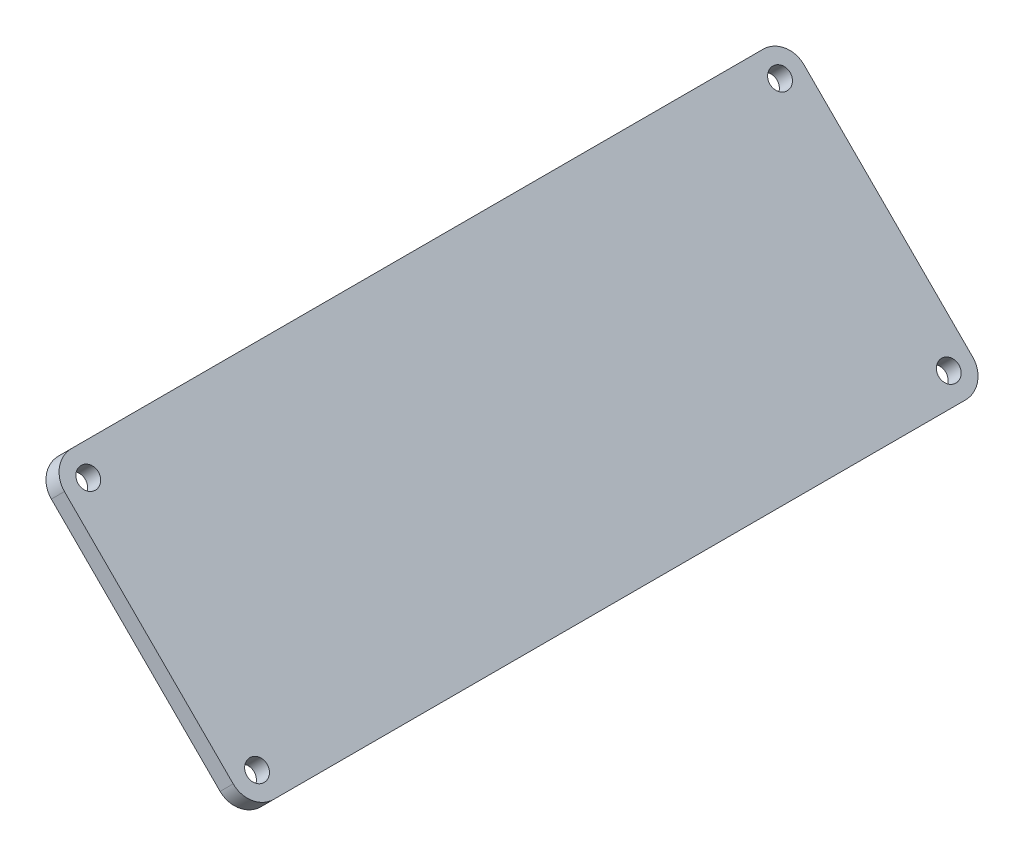
ISO-10303-21;
HEADER;
FILE_DESCRIPTION(('STEP AP214'),'2;1');
FILE_NAME('part.step','',(''),(''),'','','');
FILE_SCHEMA(('AUTOMOTIVE_DESIGN { 1 0 10303 214 1 1 1 1 }'));
ENDSEC;
DATA;
#1=APPLICATION_CONTEXT('core data for automotive mechanical design processes');
#2=APPLICATION_PROTOCOL_DEFINITION('international standard','automotive_design',2000,#1);
#3=PRODUCT_CONTEXT('',#1,'mechanical');
#4=PRODUCT('Part','Part','',(#3));
#5=PRODUCT_RELATED_PRODUCT_CATEGORY('part','',(#4));
#6=PRODUCT_DEFINITION_FORMATION('','',#4);
#7=PRODUCT_DEFINITION_CONTEXT('part definition',#1,'design');
#8=PRODUCT_DEFINITION('design','',#6,#7);
#9=PRODUCT_DEFINITION_SHAPE('','',#8);
#10=(LENGTH_UNIT() NAMED_UNIT(*) SI_UNIT(.MILLI.,.METRE.));
#11=(NAMED_UNIT(*) PLANE_ANGLE_UNIT() SI_UNIT($,.RADIAN.));
#12=(NAMED_UNIT(*) SI_UNIT($,.STERADIAN.) SOLID_ANGLE_UNIT());
#13=UNCERTAINTY_MEASURE_WITH_UNIT(LENGTH_MEASURE(1.E-05),#10,'distance_accuracy_value','');
#14=(GEOMETRIC_REPRESENTATION_CONTEXT(3) GLOBAL_UNCERTAINTY_ASSIGNED_CONTEXT((#13)) GLOBAL_UNIT_ASSIGNED_CONTEXT((#10,
#11,#12)) REPRESENTATION_CONTEXT('',''));
#15=CARTESIAN_POINT('',(0.,0.,0.));
#16=DIRECTION('',(0.,0.,1.));
#17=DIRECTION('',(1.,0.,0.));
#18=AXIS2_PLACEMENT_3D('',#15,#16,#17);
#19=CARTESIAN_POINT('',(367.826239746811,480.354328766444,453.26943762346));
#20=DIRECTION('',(0.707106781186549,0.707106781186546,0.));
#21=DIRECTION('',(-0.707106781186546,0.707106781186549,0.));
#22=AXIS2_PLACEMENT_3D('',#19,#20,#21);
#23=PLANE('',#22);
#24=CARTESIAN_POINT('',(396.124653129897,452.055915383359,453.26943762346));
#25=DIRECTION('',(0.707106781186549,0.707106781186546,0.));
#26=DIRECTION('',(-0.707106781186546,0.707106781186549,0.));
#27=AXIS2_PLACEMENT_3D('',#24,#25,#26);
#28=CIRCLE('',#27,1.70000000000007);
#29=CARTESIAN_POINT('',(394.92257160188,453.257996911376,453.26943762346));
#30=VERTEX_POINT('',#29);
#31=EDGE_CURVE('E188',#30,#30,#28,.T.);
#32=ORIENTED_EDGE('',*,*,#31,.F.);
#33=EDGE_LOOP('',(#32));
#34=FACE_BOUND('',#33,.T.);
#35=CARTESIAN_POINT('',(367.826239746811,480.354328766444,569.26943762346));
#36=DIRECTION('',(0.707106781186549,0.707106781186546,0.));
#37=DIRECTION('',(-0.707106781186546,0.707106781186549,0.));
#38=AXIS2_PLACEMENT_3D('',#35,#36,#37);
#39=CIRCLE('',#38,1.70000000000007);
#40=CARTESIAN_POINT('',(366.624158218794,481.556410294462,569.26943762346));
#41=VERTEX_POINT('',#40);
#42=EDGE_CURVE('E134',#41,#41,#39,.T.);
#43=ORIENTED_EDGE('',*,*,#42,.F.);
#44=EDGE_LOOP('',(#43));
#45=FACE_BOUND('',#44,.T.);
#46=CARTESIAN_POINT('',(367.826239746811,480.354328766444,453.26943762346));
#47=DIRECTION('',(0.707106781186549,0.707106781186546,0.));
#48=DIRECTION('',(-0.707106781186546,0.707106781186549,0.));
#49=AXIS2_PLACEMENT_3D('',#46,#47,#48);
#50=CIRCLE('',#49,4.00000000000001);
#51=CARTESIAN_POINT('',(367.826239746811,480.354328766444,449.26943762346));
#52=VERTEX_POINT('',#51);
#53=CARTESIAN_POINT('',(364.997812622065,483.182755891191,453.26943762346));
#54=VERTEX_POINT('',#53);
#55=EDGE_CURVE('E145',#52,#54,#50,.T.);
#56=ORIENTED_EDGE('',*,*,#55,.T.);
#57=DIRECTION('',(0.,0.,1.));
#58=VECTOR('',#57,1.);
#59=CARTESIAN_POINT('',(364.997812622065,483.182755891191,453.26943762346));
#60=LINE('',#59,#58);
#61=CARTESIAN_POINT('',(364.997812622065,483.182755891191,569.26943762346));
#62=VERTEX_POINT('',#61);
#63=EDGE_CURVE('E93',#54,#62,#60,.T.);
#64=ORIENTED_EDGE('',*,*,#63,.T.);
#65=CARTESIAN_POINT('',(367.826239746811,480.354328766444,569.26943762346));
#66=DIRECTION('',(0.707106781186549,0.707106781186546,0.));
#67=DIRECTION('',(-0.707106781186546,0.707106781186549,0.));
#68=AXIS2_PLACEMENT_3D('',#65,#66,#67);
#69=CIRCLE('',#68,4.00000000000003);
#70=CARTESIAN_POINT('',(367.826239746811,480.354328766444,573.26943762346));
#71=VERTEX_POINT('',#70);
#72=EDGE_CURVE('E160',#62,#71,#69,.T.);
#73=ORIENTED_EDGE('',*,*,#72,.T.);
#74=DIRECTION('',(0.707106781186546,-0.707106781186549,0.));
#75=VECTOR('',#74,1.);
#76=CARTESIAN_POINT('',(367.826239746811,480.354328766444,573.26943762346));
#77=LINE('',#76,#75);
#78=CARTESIAN_POINT('',(396.124653129897,452.055915383359,573.26943762346));
#79=VERTEX_POINT('',#78);
#80=EDGE_CURVE('E173',#71,#79,#77,.T.);
#81=ORIENTED_EDGE('',*,*,#80,.T.);
#82=CARTESIAN_POINT('',(396.124653129897,452.055915383359,569.26943762346));
#83=DIRECTION('',(0.707106781186549,0.707106781186546,0.));
#84=DIRECTION('',(-0.707106781186546,0.707106781186549,0.));
#85=AXIS2_PLACEMENT_3D('',#82,#83,#84);
#86=CIRCLE('',#85,3.99999999999999);
#87=CARTESIAN_POINT('',(398.953080254643,449.227488258613,569.26943762346));
#88=VERTEX_POINT('',#87);
#89=EDGE_CURVE('E112',#79,#88,#86,.T.);
#90=ORIENTED_EDGE('',*,*,#89,.T.);
#91=DIRECTION('',(0.,0.,-1.));
#92=VECTOR('',#91,1.);
#93=CARTESIAN_POINT('',(398.953080254643,449.227488258613,569.26943762346));
#94=LINE('',#93,#92);
#95=CARTESIAN_POINT('',(398.953080254643,449.227488258613,453.26943762346));
#96=VERTEX_POINT('',#95);
#97=EDGE_CURVE('E106',#88,#96,#94,.T.);
#98=ORIENTED_EDGE('',*,*,#97,.T.);
#99=CARTESIAN_POINT('',(396.124653129897,452.055915383359,453.26943762346));
#100=DIRECTION('',(0.707106781186549,0.707106781186546,0.));
#101=DIRECTION('',(-0.707106781186546,0.707106781186549,0.));
#102=AXIS2_PLACEMENT_3D('',#99,#100,#101);
#103=CIRCLE('',#102,3.99999999999999);
#104=CARTESIAN_POINT('',(396.124653129897,452.055915383359,449.26943762346));
#105=VERTEX_POINT('',#104);
#106=EDGE_CURVE('E110',#96,#105,#103,.T.);
#107=ORIENTED_EDGE('',*,*,#106,.T.);
#108=DIRECTION('',(-0.707106781186546,0.707106781186549,0.));
#109=VECTOR('',#108,1.);
#110=CARTESIAN_POINT('',(396.124653129897,452.055915383359,449.26943762346));
#111=LINE('',#110,#109);
#112=EDGE_CURVE('E50',#105,#52,#111,.T.);
#113=ORIENTED_EDGE('',*,*,#112,.T.);
#114=EDGE_LOOP('',(#56,#64,#73,#81,#90,#98,#107,#113));
#115=FACE_BOUND('',#114,.T.);
#116=CARTESIAN_POINT('',(396.124653129897,452.055915383359,569.26943762346));
#117=DIRECTION('',(0.707106781186549,0.707106781186546,0.));
#118=DIRECTION('',(-0.707106781186546,0.707106781186549,0.));
#119=AXIS2_PLACEMENT_3D('',#116,#117,#118);
#120=CIRCLE('',#119,1.7000000000003);
#121=CARTESIAN_POINT('',(394.92257160188,453.257996911376,569.26943762346));
#122=VERTEX_POINT('',#121);
#123=EDGE_CURVE('E182',#122,#122,#120,.T.);
#124=ORIENTED_EDGE('',*,*,#123,.F.);
#125=EDGE_LOOP('',(#124));
#126=FACE_BOUND('',#125,.T.);
#127=CARTESIAN_POINT('',(367.826239746811,480.354328766444,453.26943762346));
#128=DIRECTION('',(0.707106781186549,0.707106781186546,0.));
#129=DIRECTION('',(-0.707106781186546,0.707106781186549,0.));
#130=AXIS2_PLACEMENT_3D('',#127,#128,#129);
#131=CIRCLE('',#130,1.70000000000009);
#132=CARTESIAN_POINT('',(366.624158218794,481.556410294462,453.26943762346));
#133=VERTEX_POINT('',#132);
#134=EDGE_CURVE('E194',#133,#133,#131,.T.);
#135=ORIENTED_EDGE('',*,*,#134,.F.);
#136=EDGE_LOOP('',(#135));
#137=FACE_BOUND('',#136,.T.);
#138=ADVANCED_FACE('F33',(#34,#45,#115,#126,#137),#23,.T.);
#139=CARTESIAN_POINT('',(365.634208725133,478.162297744766,453.26943762346));
#140=DIRECTION('',(0.707106781186549,0.707106781186546,0.));
#141=DIRECTION('',(-0.707106781186546,0.707106781186549,0.));
#142=AXIS2_PLACEMENT_3D('',#139,#140,#141);
#143=PLANE('',#142);
#144=CARTESIAN_POINT('',(365.634208725133,478.162297744766,453.26943762346));
#145=DIRECTION('',(0.707106781186549,0.707106781186546,0.));
#146=DIRECTION('',(-0.707106781186546,0.707106781186549,0.));
#147=AXIS2_PLACEMENT_3D('',#144,#145,#146);
#148=CIRCLE('',#147,4.00000000000001);
#149=CARTESIAN_POINT('',(365.634208725133,478.162297744766,449.26943762346));
#150=VERTEX_POINT('',#149);
#151=CARTESIAN_POINT('',(362.805781600387,480.990724869512,453.26943762346));
#152=VERTEX_POINT('',#151);
#153=EDGE_CURVE('E130',#150,#152,#148,.T.);
#154=ORIENTED_EDGE('',*,*,#153,.F.);
#155=DIRECTION('',(-0.707106781186546,0.707106781186549,0.));
#156=VECTOR('',#155,1.);
#157=CARTESIAN_POINT('',(393.932622108219,449.86388436168,449.26943762346));
#158=LINE('',#157,#156);
#159=CARTESIAN_POINT('',(393.932622108219,449.86388436168,449.26943762346));
#160=VERTEX_POINT('',#159);
#161=EDGE_CURVE('E85',#160,#150,#158,.T.);
#162=ORIENTED_EDGE('',*,*,#161,.F.);
#163=CARTESIAN_POINT('',(393.932622108219,449.86388436168,453.26943762346));
#164=DIRECTION('',(0.707106781186549,0.707106781186546,0.));
#165=DIRECTION('',(-0.707106781186546,0.707106781186549,0.));
#166=AXIS2_PLACEMENT_3D('',#163,#164,#165);
#167=CIRCLE('',#166,3.99999999999999);
#168=CARTESIAN_POINT('',(396.761049232965,447.035457236934,453.26943762346));
#169=VERTEX_POINT('',#168);
#170=EDGE_CURVE('E79',#169,#160,#167,.T.);
#171=ORIENTED_EDGE('',*,*,#170,.F.);
#172=DIRECTION('',(0.,0.,-1.));
#173=VECTOR('',#172,1.);
#174=CARTESIAN_POINT('',(396.761049232965,447.035457236934,569.26943762346));
#175=LINE('',#174,#173);
#176=CARTESIAN_POINT('',(396.761049232965,447.035457236934,569.26943762346));
#177=VERTEX_POINT('',#176);
#178=EDGE_CURVE('E120',#177,#169,#175,.T.);
#179=ORIENTED_EDGE('',*,*,#178,.F.);
#180=CARTESIAN_POINT('',(393.932622108219,449.86388436168,569.26943762346));
#181=DIRECTION('',(0.707106781186549,0.707106781186546,0.));
#182=DIRECTION('',(-0.707106781186546,0.707106781186549,0.));
#183=AXIS2_PLACEMENT_3D('',#180,#181,#182);
#184=CIRCLE('',#183,3.99999999999999);
#185=CARTESIAN_POINT('',(393.932622108219,449.86388436168,573.26943762346));
#186=VERTEX_POINT('',#185);
#187=EDGE_CURVE('E140',#186,#177,#184,.T.);
#188=ORIENTED_EDGE('',*,*,#187,.F.);
#189=DIRECTION('',(0.707106781186546,-0.707106781186549,0.));
#190=VECTOR('',#189,1.);
#191=CARTESIAN_POINT('',(365.634208725133,478.162297744766,573.26943762346));
#192=LINE('',#191,#190);
#193=CARTESIAN_POINT('',(365.634208725133,478.162297744766,573.26943762346));
#194=VERTEX_POINT('',#193);
#195=EDGE_CURVE('E138',#194,#186,#192,.T.);
#196=ORIENTED_EDGE('',*,*,#195,.F.);
#197=CARTESIAN_POINT('',(365.634208725133,478.162297744766,569.26943762346));
#198=DIRECTION('',(0.707106781186549,0.707106781186546,0.));
#199=DIRECTION('',(-0.707106781186546,0.707106781186549,0.));
#200=AXIS2_PLACEMENT_3D('',#197,#198,#199);
#201=CIRCLE('',#200,4.00000000000003);
#202=CARTESIAN_POINT('',(362.805781600387,480.990724869512,569.26943762346));
#203=VERTEX_POINT('',#202);
#204=EDGE_CURVE('E136',#203,#194,#201,.T.);
#205=ORIENTED_EDGE('',*,*,#204,.F.);
#206=DIRECTION('',(0.,0.,1.));
#207=VECTOR('',#206,1.);
#208=CARTESIAN_POINT('',(362.805781600387,480.990724869512,453.26943762346));
#209=LINE('',#208,#207);
#210=EDGE_CURVE('E133',#152,#203,#209,.T.);
#211=ORIENTED_EDGE('',*,*,#210,.F.);
#212=EDGE_LOOP('',(#154,#162,#171,#179,#188,#196,#205,#211));
#213=FACE_BOUND('',#212,.T.);
#214=CARTESIAN_POINT('',(365.634208725133,478.162297744766,569.26943762346));
#215=DIRECTION('',(0.707106781186549,0.707106781186546,0.));
#216=DIRECTION('',(-0.707106781186546,0.707106781186549,0.));
#217=AXIS2_PLACEMENT_3D('',#214,#215,#216);
#218=CIRCLE('',#217,1.70000000000007);
#219=CARTESIAN_POINT('',(364.432127197116,479.364379272783,569.26943762346));
#220=VERTEX_POINT('',#219);
#221=EDGE_CURVE('E179',#220,#220,#218,.T.);
#222=ORIENTED_EDGE('',*,*,#221,.T.);
#223=EDGE_LOOP('',(#222));
#224=FACE_BOUND('',#223,.T.);
#225=CARTESIAN_POINT('',(393.932622108219,449.86388436168,569.26943762346));
#226=DIRECTION('',(0.707106781186549,0.707106781186546,0.));
#227=DIRECTION('',(-0.707106781186546,0.707106781186549,0.));
#228=AXIS2_PLACEMENT_3D('',#225,#226,#227);
#229=CIRCLE('',#228,1.7000000000003);
#230=CARTESIAN_POINT('',(392.730540580201,451.065965889698,569.26943762346));
#231=VERTEX_POINT('',#230);
#232=EDGE_CURVE('E185',#231,#231,#229,.T.);
#233=ORIENTED_EDGE('',*,*,#232,.T.);
#234=EDGE_LOOP('',(#233));
#235=FACE_BOUND('',#234,.T.);
#236=CARTESIAN_POINT('',(393.932622108219,449.86388436168,453.26943762346));
#237=DIRECTION('',(0.707106781186549,0.707106781186546,0.));
#238=DIRECTION('',(-0.707106781186546,0.707106781186549,0.));
#239=AXIS2_PLACEMENT_3D('',#236,#237,#238);
#240=CIRCLE('',#239,1.70000000000007);
#241=CARTESIAN_POINT('',(392.730540580201,451.065965889698,453.26943762346));
#242=VERTEX_POINT('',#241);
#243=EDGE_CURVE('E191',#242,#242,#240,.T.);
#244=ORIENTED_EDGE('',*,*,#243,.T.);
#245=EDGE_LOOP('',(#244));
#246=FACE_BOUND('',#245,.T.);
#247=CARTESIAN_POINT('',(365.634208725133,478.162297744766,453.26943762346));
#248=DIRECTION('',(0.707106781186549,0.707106781186546,0.));
#249=DIRECTION('',(-0.707106781186546,0.707106781186549,0.));
#250=AXIS2_PLACEMENT_3D('',#247,#248,#249);
#251=CIRCLE('',#250,1.70000000000009);
#252=CARTESIAN_POINT('',(364.432127197116,479.364379272783,453.26943762346));
#253=VERTEX_POINT('',#252);
#254=EDGE_CURVE('E197',#253,#253,#251,.T.);
#255=ORIENTED_EDGE('',*,*,#254,.T.);
#256=EDGE_LOOP('',(#255));
#257=FACE_BOUND('',#256,.T.);
#258=ADVANCED_FACE('F164',(#213,#224,#235,#246,#257),#143,.F.);
#259=CARTESIAN_POINT('',(367.826239746811,480.354328766444,453.26943762346));
#260=DIRECTION('',(-0.707106781186549,-0.707106781186546,0.));
#261=DIRECTION('',(0.707106781186546,-0.707106781186549,0.));
#262=AXIS2_PLACEMENT_3D('',#259,#260,#261);
#263=CYLINDRICAL_SURFACE('',#262,4.00000000000001);
#264=ORIENTED_EDGE('',*,*,#153,.T.);
#265=DIRECTION('',(-0.707106781186549,-0.707106781186546,0.));
#266=VECTOR('',#265,1.);
#267=CARTESIAN_POINT('',(364.997812622065,483.182755891191,453.26943762346));
#268=LINE('',#267,#266);
#269=EDGE_CURVE('E11',#54,#152,#268,.T.);
#270=ORIENTED_EDGE('',*,*,#269,.F.);
#271=ORIENTED_EDGE('',*,*,#55,.F.);
#272=DIRECTION('',(-0.707106781186549,-0.707106781186546,0.));
#273=VECTOR('',#272,1.);
#274=CARTESIAN_POINT('',(367.826239746811,480.354328766444,449.26943762346));
#275=LINE('',#274,#273);
#276=EDGE_CURVE('E126',#52,#150,#275,.T.);
#277=ORIENTED_EDGE('',*,*,#276,.T.);
#278=EDGE_LOOP('',(#264,#270,#271,#277));
#279=FACE_BOUND('',#278,.T.);
#280=ADVANCED_FACE('F35',(#279),#263,.T.);
#281=CARTESIAN_POINT('',(364.997812622065,483.182755891191,453.26943762346));
#282=DIRECTION('',(0.707106781186546,-0.707106781186549,0.));
#283=DIRECTION('',(0.707106781186549,0.707106781186546,0.));
#284=AXIS2_PLACEMENT_3D('',#281,#282,#283);
#285=PLANE('',#284);
#286=ORIENTED_EDGE('',*,*,#210,.T.);
#287=DIRECTION('',(-0.707106781186549,-0.707106781186546,0.));
#288=VECTOR('',#287,1.);
#289=CARTESIAN_POINT('',(364.997812622065,483.182755891191,569.26943762346));
#290=LINE('',#289,#288);
#291=EDGE_CURVE('E42',#62,#203,#290,.T.);
#292=ORIENTED_EDGE('',*,*,#291,.F.);
#293=ORIENTED_EDGE('',*,*,#63,.F.);
#294=ORIENTED_EDGE('',*,*,#269,.T.);
#295=EDGE_LOOP('',(#286,#292,#293,#294));
#296=FACE_BOUND('',#295,.T.);
#297=ADVANCED_FACE('F231',(#296),#285,.F.);
#298=CARTESIAN_POINT('',(367.826239746811,480.354328766444,569.26943762346));
#299=DIRECTION('',(-0.707106781186549,-0.707106781186546,0.));
#300=DIRECTION('',(0.707106781186546,-0.707106781186549,0.));
#301=AXIS2_PLACEMENT_3D('',#298,#299,#300);
#302=CYLINDRICAL_SURFACE('',#301,4.00000000000003);
#303=ORIENTED_EDGE('',*,*,#204,.T.);
#304=DIRECTION('',(-0.707106781186549,-0.707106781186546,0.));
#305=VECTOR('',#304,1.);
#306=CARTESIAN_POINT('',(367.826239746811,480.354328766444,573.26943762346));
#307=LINE('',#306,#305);
#308=EDGE_CURVE('E152',#71,#194,#307,.T.);
#309=ORIENTED_EDGE('',*,*,#308,.F.);
#310=ORIENTED_EDGE('',*,*,#72,.F.);
#311=ORIENTED_EDGE('',*,*,#291,.T.);
#312=EDGE_LOOP('',(#303,#309,#310,#311));
#313=FACE_BOUND('',#312,.T.);
#314=ADVANCED_FACE('F158',(#313),#302,.T.);
#315=CARTESIAN_POINT('',(367.826239746811,480.354328766444,573.26943762346));
#316=DIRECTION('',(0.,0.,-1.));
#317=DIRECTION('',(-1.,0.,0.));
#318=AXIS2_PLACEMENT_3D('',#315,#316,#317);
#319=PLANE('',#318);
#320=ORIENTED_EDGE('',*,*,#195,.T.);
#321=DIRECTION('',(-0.707106781186549,-0.707106781186546,0.));
#322=VECTOR('',#321,1.);
#323=CARTESIAN_POINT('',(396.124653129897,452.055915383359,573.26943762346));
#324=LINE('',#323,#322);
#325=EDGE_CURVE('E149',#79,#186,#324,.T.);
#326=ORIENTED_EDGE('',*,*,#325,.F.);
#327=ORIENTED_EDGE('',*,*,#80,.F.);
#328=ORIENTED_EDGE('',*,*,#308,.T.);
#329=EDGE_LOOP('',(#320,#326,#327,#328));
#330=FACE_BOUND('',#329,.T.);
#331=ADVANCED_FACE('F169',(#330),#319,.F.);
#332=CARTESIAN_POINT('',(396.124653129897,452.055915383359,569.26943762346));
#333=DIRECTION('',(-0.707106781186549,-0.707106781186546,0.));
#334=DIRECTION('',(0.707106781186546,-0.707106781186549,0.));
#335=AXIS2_PLACEMENT_3D('',#332,#333,#334);
#336=CYLINDRICAL_SURFACE('',#335,3.99999999999999);
#337=ORIENTED_EDGE('',*,*,#187,.T.);
#338=DIRECTION('',(-0.707106781186549,-0.707106781186546,0.));
#339=VECTOR('',#338,1.);
#340=CARTESIAN_POINT('',(398.953080254643,449.227488258613,569.26943762346));
#341=LINE('',#340,#339);
#342=EDGE_CURVE('E121',#88,#177,#341,.T.);
#343=ORIENTED_EDGE('',*,*,#342,.F.);
#344=ORIENTED_EDGE('',*,*,#89,.F.);
#345=ORIENTED_EDGE('',*,*,#325,.T.);
#346=EDGE_LOOP('',(#337,#343,#344,#345));
#347=FACE_BOUND('',#346,.T.);
#348=ADVANCED_FACE('F172',(#347),#336,.T.);
#349=CARTESIAN_POINT('',(398.953080254643,449.227488258613,569.26943762346));
#350=DIRECTION('',(-0.707106781186546,0.707106781186549,0.));
#351=DIRECTION('',(-0.707106781186549,-0.707106781186546,0.));
#352=AXIS2_PLACEMENT_3D('',#349,#350,#351);
#353=PLANE('',#352);
#354=ORIENTED_EDGE('',*,*,#178,.T.);
#355=DIRECTION('',(-0.707106781186549,-0.707106781186546,0.));
#356=VECTOR('',#355,1.);
#357=CARTESIAN_POINT('',(398.953080254643,449.227488258613,453.26943762346));
#358=LINE('',#357,#356);
#359=EDGE_CURVE('E117',#96,#169,#358,.T.);
#360=ORIENTED_EDGE('',*,*,#359,.F.);
#361=ORIENTED_EDGE('',*,*,#97,.F.);
#362=ORIENTED_EDGE('',*,*,#342,.T.);
#363=EDGE_LOOP('',(#354,#360,#361,#362));
#364=FACE_BOUND('',#363,.T.);
#365=ADVANCED_FACE('F118',(#364),#353,.F.);
#366=CARTESIAN_POINT('',(396.124653129897,452.055915383359,453.26943762346));
#367=DIRECTION('',(-0.707106781186549,-0.707106781186546,0.));
#368=DIRECTION('',(0.707106781186546,-0.707106781186549,0.));
#369=AXIS2_PLACEMENT_3D('',#366,#367,#368);
#370=CYLINDRICAL_SURFACE('',#369,3.99999999999999);
#371=ORIENTED_EDGE('',*,*,#170,.T.);
#372=DIRECTION('',(-0.707106781186549,-0.707106781186546,0.));
#373=VECTOR('',#372,1.);
#374=CARTESIAN_POINT('',(396.124653129897,452.055915383359,449.26943762346));
#375=LINE('',#374,#373);
#376=EDGE_CURVE('E122',#105,#160,#375,.T.);
#377=ORIENTED_EDGE('',*,*,#376,.F.);
#378=ORIENTED_EDGE('',*,*,#106,.F.);
#379=ORIENTED_EDGE('',*,*,#359,.T.);
#380=EDGE_LOOP('',(#371,#377,#378,#379));
#381=FACE_BOUND('',#380,.T.);
#382=ADVANCED_FACE('F124',(#381),#370,.T.);
#383=CARTESIAN_POINT('',(396.124653129897,452.055915383359,449.26943762346));
#384=DIRECTION('',(0.,0.,1.));
#385=DIRECTION('',(1.,0.,0.));
#386=AXIS2_PLACEMENT_3D('',#383,#384,#385);
#387=PLANE('',#386);
#388=ORIENTED_EDGE('',*,*,#161,.T.);
#389=ORIENTED_EDGE('',*,*,#276,.F.);
#390=ORIENTED_EDGE('',*,*,#112,.F.);
#391=ORIENTED_EDGE('',*,*,#376,.T.);
#392=EDGE_LOOP('',(#388,#389,#390,#391));
#393=FACE_BOUND('',#392,.T.);
#394=ADVANCED_FACE('F219',(#393),#387,.F.);
#395=CARTESIAN_POINT('',(367.826239746811,480.354328766444,569.26943762346));
#396=DIRECTION('',(-0.707106781186549,-0.707106781186546,0.));
#397=DIRECTION('',(0.707106781186546,-0.707106781186549,0.));
#398=AXIS2_PLACEMENT_3D('',#395,#396,#397);
#399=CYLINDRICAL_SURFACE('',#398,1.70000000000007);
#400=ORIENTED_EDGE('',*,*,#42,.T.);
#401=EDGE_LOOP('',(#400));
#402=FACE_BOUND('',#401,.T.);
#403=ORIENTED_EDGE('',*,*,#221,.F.);
#404=EDGE_LOOP('',(#403));
#405=FACE_BOUND('',#404,.T.);
#406=ADVANCED_FACE('F216',(#402,#405),#399,.F.);
#407=CARTESIAN_POINT('',(396.124653129897,452.055915383359,569.26943762346));
#408=DIRECTION('',(-0.707106781186549,-0.707106781186546,0.));
#409=DIRECTION('',(0.707106781186546,-0.707106781186549,0.));
#410=AXIS2_PLACEMENT_3D('',#407,#408,#409);
#411=CYLINDRICAL_SURFACE('',#410,1.7000000000003);
#412=ORIENTED_EDGE('',*,*,#123,.T.);
#413=EDGE_LOOP('',(#412));
#414=FACE_BOUND('',#413,.T.);
#415=ORIENTED_EDGE('',*,*,#232,.F.);
#416=EDGE_LOOP('',(#415));
#417=FACE_BOUND('',#416,.T.);
#418=ADVANCED_FACE('F295',(#414,#417),#411,.F.);
#419=CARTESIAN_POINT('',(396.124653129897,452.055915383359,453.26943762346));
#420=DIRECTION('',(-0.707106781186549,-0.707106781186546,0.));
#421=DIRECTION('',(0.707106781186546,-0.707106781186549,0.));
#422=AXIS2_PLACEMENT_3D('',#419,#420,#421);
#423=CYLINDRICAL_SURFACE('',#422,1.70000000000007);
#424=ORIENTED_EDGE('',*,*,#31,.T.);
#425=EDGE_LOOP('',(#424));
#426=FACE_BOUND('',#425,.T.);
#427=ORIENTED_EDGE('',*,*,#243,.F.);
#428=EDGE_LOOP('',(#427));
#429=FACE_BOUND('',#428,.T.);
#430=ADVANCED_FACE('F303',(#426,#429),#423,.F.);
#431=CARTESIAN_POINT('',(367.826239746811,480.354328766444,453.26943762346));
#432=DIRECTION('',(-0.707106781186549,-0.707106781186546,0.));
#433=DIRECTION('',(0.707106781186546,-0.707106781186549,0.));
#434=AXIS2_PLACEMENT_3D('',#431,#432,#433);
#435=CYLINDRICAL_SURFACE('',#434,1.70000000000009);
#436=ORIENTED_EDGE('',*,*,#134,.T.);
#437=EDGE_LOOP('',(#436));
#438=FACE_BOUND('',#437,.T.);
#439=ORIENTED_EDGE('',*,*,#254,.F.);
#440=EDGE_LOOP('',(#439));
#441=FACE_BOUND('',#440,.T.);
#442=ADVANCED_FACE('F203',(#438,#441),#435,.F.);
#443=CLOSED_SHELL('',(#138,#258,#280,#297,#314,#331,#348,#365,#382,#394,#406,#418,#430,#442));
#444=MANIFOLD_SOLID_BREP('B2',#443);
#445=ADVANCED_BREP_SHAPE_REPRESENTATION('',(#18,#444),#14);
#446=SHAPE_DEFINITION_REPRESENTATION(#9,#445);
ENDSEC;
END-ISO-10303-21;
